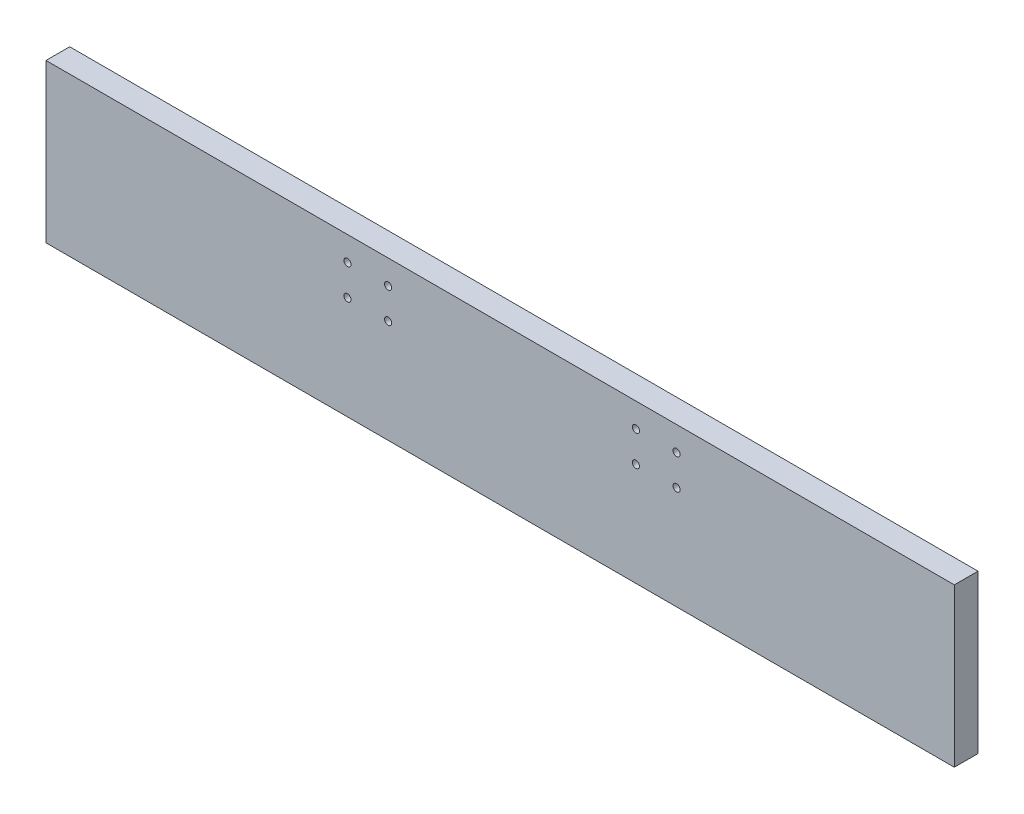
ISO-10303-21;
HEADER;
FILE_DESCRIPTION(('STEP AP214'),'2;1');
FILE_NAME('part.step','',(''),(''),'','','');
FILE_SCHEMA(('AUTOMOTIVE_DESIGN { 1 0 10303 214 1 1 1 1 }'));
ENDSEC;
DATA;
#1=APPLICATION_CONTEXT('core data for automotive mechanical design processes');
#2=APPLICATION_PROTOCOL_DEFINITION('international standard','automotive_design',2000,#1);
#3=PRODUCT_CONTEXT('',#1,'mechanical');
#4=PRODUCT('Part','Part','',(#3));
#5=PRODUCT_RELATED_PRODUCT_CATEGORY('part','',(#4));
#6=PRODUCT_DEFINITION_FORMATION('','',#4);
#7=PRODUCT_DEFINITION_CONTEXT('part definition',#1,'design');
#8=PRODUCT_DEFINITION('design','',#6,#7);
#9=PRODUCT_DEFINITION_SHAPE('','',#8);
#10=(LENGTH_UNIT() NAMED_UNIT(*) SI_UNIT(.MILLI.,.METRE.));
#11=(NAMED_UNIT(*) PLANE_ANGLE_UNIT() SI_UNIT($,.RADIAN.));
#12=(NAMED_UNIT(*) SI_UNIT($,.STERADIAN.) SOLID_ANGLE_UNIT());
#13=UNCERTAINTY_MEASURE_WITH_UNIT(LENGTH_MEASURE(1.E-05),#10,'distance_accuracy_value','');
#14=(GEOMETRIC_REPRESENTATION_CONTEXT(3) GLOBAL_UNCERTAINTY_ASSIGNED_CONTEXT((#13)) GLOBAL_UNIT_ASSIGNED_CONTEXT((#10,
#11,#12)) REPRESENTATION_CONTEXT('',''));
#15=CARTESIAN_POINT('',(0.,0.,0.));
#16=DIRECTION('',(0.,0.,1.));
#17=DIRECTION('',(1.,0.,0.));
#18=AXIS2_PLACEMENT_3D('',#15,#16,#17);
#19=CARTESIAN_POINT('',(0.,0.,19.05));
#20=DIRECTION('',(1.,0.,0.));
#21=DIRECTION('',(0.,0.,-1.));
#22=AXIS2_PLACEMENT_3D('',#19,#20,#21);
#23=PLANE('',#22);
#24=DIRECTION('',(0.,-1.,0.));
#25=VECTOR('',#24,1.);
#26=CARTESIAN_POINT('',(0.,0.,0.));
#27=LINE('',#26,#25);
#28=CARTESIAN_POINT('',(0.,127.,0.));
#29=VERTEX_POINT('',#28);
#30=CARTESIAN_POINT('',(0.,0.,0.));
#31=VERTEX_POINT('',#30);
#32=EDGE_CURVE('E96',#29,#31,#27,.T.);
#33=ORIENTED_EDGE('',*,*,#32,.T.);
#34=DIRECTION('',(0.,0.,-1.));
#35=VECTOR('',#34,1.);
#36=CARTESIAN_POINT('',(0.,0.,19.05));
#37=LINE('',#36,#35);
#38=CARTESIAN_POINT('',(0.,0.,19.05));
#39=VERTEX_POINT('',#38);
#40=EDGE_CURVE('E11',#39,#31,#37,.T.);
#41=ORIENTED_EDGE('',*,*,#40,.F.);
#42=DIRECTION('',(0.,-1.,0.));
#43=VECTOR('',#42,1.);
#44=CARTESIAN_POINT('',(0.,0.,19.05));
#45=LINE('',#44,#43);
#46=CARTESIAN_POINT('',(0.,127.,19.05));
#47=VERTEX_POINT('',#46);
#48=EDGE_CURVE('E84',#47,#39,#45,.T.);
#49=ORIENTED_EDGE('',*,*,#48,.F.);
#50=DIRECTION('',(0.,0.,-1.));
#51=VECTOR('',#50,1.);
#52=CARTESIAN_POINT('',(0.,127.,19.05));
#53=LINE('',#52,#51);
#54=EDGE_CURVE('E92',#47,#29,#53,.T.);
#55=ORIENTED_EDGE('',*,*,#54,.T.);
#56=EDGE_LOOP('',(#33,#41,#49,#55));
#57=FACE_BOUND('',#56,.T.);
#58=ADVANCED_FACE('F33',(#57),#23,.F.);
#59=CARTESIAN_POINT('',(0.,0.,19.05));
#60=DIRECTION('',(0.,1.,0.));
#61=DIRECTION('',(0.,0.,1.));
#62=AXIS2_PLACEMENT_3D('',#59,#60,#61);
#63=PLANE('',#62);
#64=DIRECTION('',(1.,0.,0.));
#65=VECTOR('',#64,1.);
#66=CARTESIAN_POINT('',(0.,0.,0.));
#67=LINE('',#66,#65);
#68=CARTESIAN_POINT('',(730.25,0.,0.));
#69=VERTEX_POINT('',#68);
#70=EDGE_CURVE('E88',#31,#69,#67,.T.);
#71=ORIENTED_EDGE('',*,*,#70,.T.);
#72=DIRECTION('',(0.,0.,-1.));
#73=VECTOR('',#72,1.);
#74=CARTESIAN_POINT('',(730.25,0.,19.05));
#75=LINE('',#74,#73);
#76=CARTESIAN_POINT('',(730.25,0.,19.05));
#77=VERTEX_POINT('',#76);
#78=EDGE_CURVE('E41',#77,#69,#75,.T.);
#79=ORIENTED_EDGE('',*,*,#78,.F.);
#80=DIRECTION('',(1.,0.,0.));
#81=VECTOR('',#80,1.);
#82=CARTESIAN_POINT('',(0.,0.,19.05));
#83=LINE('',#82,#81);
#84=EDGE_CURVE('E79',#39,#77,#83,.T.);
#85=ORIENTED_EDGE('',*,*,#84,.F.);
#86=ORIENTED_EDGE('',*,*,#40,.T.);
#87=EDGE_LOOP('',(#71,#79,#85,#86));
#88=FACE_BOUND('',#87,.T.);
#89=ADVANCED_FACE('F87',(#88),#63,.F.);
#90=CARTESIAN_POINT('',(730.25,0.,19.05));
#91=DIRECTION('',(-1.,0.,0.));
#92=DIRECTION('',(0.,0.,1.));
#93=AXIS2_PLACEMENT_3D('',#90,#91,#92);
#94=PLANE('',#93);
#95=DIRECTION('',(0.,1.,0.));
#96=VECTOR('',#95,1.);
#97=CARTESIAN_POINT('',(730.25,0.,0.));
#98=LINE('',#97,#96);
#99=CARTESIAN_POINT('',(730.25,127.,0.));
#100=VERTEX_POINT('',#99);
#101=EDGE_CURVE('E66',#69,#100,#98,.T.);
#102=ORIENTED_EDGE('',*,*,#101,.T.);
#103=DIRECTION('',(0.,0.,-1.));
#104=VECTOR('',#103,1.);
#105=CARTESIAN_POINT('',(730.25,127.,19.05));
#106=LINE('',#105,#104);
#107=CARTESIAN_POINT('',(730.25,127.,19.05));
#108=VERTEX_POINT('',#107);
#109=EDGE_CURVE('E89',#108,#100,#106,.T.);
#110=ORIENTED_EDGE('',*,*,#109,.F.);
#111=DIRECTION('',(0.,1.,0.));
#112=VECTOR('',#111,1.);
#113=CARTESIAN_POINT('',(730.25,0.,19.05));
#114=LINE('',#113,#112);
#115=EDGE_CURVE('E82',#77,#108,#114,.T.);
#116=ORIENTED_EDGE('',*,*,#115,.F.);
#117=ORIENTED_EDGE('',*,*,#78,.T.);
#118=EDGE_LOOP('',(#102,#110,#116,#117));
#119=FACE_BOUND('',#118,.T.);
#120=ADVANCED_FACE('F90',(#119),#94,.F.);
#121=CARTESIAN_POINT('',(0.,127.,19.05));
#122=DIRECTION('',(0.,-1.,0.));
#123=DIRECTION('',(0.,0.,-1.));
#124=AXIS2_PLACEMENT_3D('',#121,#122,#123);
#125=PLANE('',#124);
#126=DIRECTION('',(-1.,0.,0.));
#127=VECTOR('',#126,1.);
#128=CARTESIAN_POINT('',(0.,127.,0.));
#129=LINE('',#128,#127);
#130=EDGE_CURVE('E72',#100,#29,#129,.T.);
#131=ORIENTED_EDGE('',*,*,#130,.T.);
#132=ORIENTED_EDGE('',*,*,#54,.F.);
#133=DIRECTION('',(-1.,0.,0.));
#134=VECTOR('',#133,1.);
#135=CARTESIAN_POINT('',(0.,127.,19.05));
#136=LINE('',#135,#134);
#137=EDGE_CURVE('E49',#108,#47,#136,.T.);
#138=ORIENTED_EDGE('',*,*,#137,.F.);
#139=ORIENTED_EDGE('',*,*,#109,.T.);
#140=EDGE_LOOP('',(#131,#132,#138,#139));
#141=FACE_BOUND('',#140,.T.);
#142=ADVANCED_FACE('F104',(#141),#125,.F.);
#143=CARTESIAN_POINT('',(0.,0.,19.05));
#144=DIRECTION('',(0.,0.,-1.));
#145=DIRECTION('',(-1.,0.,0.));
#146=AXIS2_PLACEMENT_3D('',#143,#144,#145);
#147=PLANE('',#146);
#148=CARTESIAN_POINT('',(242.373149999996,107.537250000002,19.05));
#149=DIRECTION('',(0.,0.,1.));
#150=DIRECTION('',(1.,0.,0.));
#151=AXIS2_PLACEMENT_3D('',#148,#149,#150);
#152=CIRCLE('',#151,2.85115);
#153=CARTESIAN_POINT('',(245.224299999996,107.537250000002,19.05));
#154=VERTEX_POINT('',#153);
#155=EDGE_CURVE('E113',#154,#154,#152,.T.);
#156=ORIENTED_EDGE('',*,*,#155,.F.);
#157=EDGE_LOOP('',(#156));
#158=FACE_BOUND('',#157,.T.);
#159=CARTESIAN_POINT('',(275.024849999996,107.537250000002,19.05));
#160=DIRECTION('',(0.,0.,1.));
#161=DIRECTION('',(1.,0.,0.));
#162=AXIS2_PLACEMENT_3D('',#159,#160,#161);
#163=CIRCLE('',#162,2.85115000000003);
#164=CARTESIAN_POINT('',(277.875999999996,107.537250000002,19.05));
#165=VERTEX_POINT('',#164);
#166=EDGE_CURVE('E132',#165,#165,#163,.T.);
#167=ORIENTED_EDGE('',*,*,#166,.F.);
#168=EDGE_LOOP('',(#167));
#169=FACE_BOUND('',#168,.T.);
#170=CARTESIAN_POINT('',(275.024849999997,82.9627500000021,19.05));
#171=DIRECTION('',(0.,0.,1.));
#172=DIRECTION('',(1.,0.,0.));
#173=AXIS2_PLACEMENT_3D('',#170,#171,#172);
#174=CIRCLE('',#173,2.85114999999997);
#175=CARTESIAN_POINT('',(277.875999999997,82.9627500000021,19.05));
#176=VERTEX_POINT('',#175);
#177=EDGE_CURVE('E126',#176,#176,#174,.T.);
#178=ORIENTED_EDGE('',*,*,#177,.F.);
#179=EDGE_LOOP('',(#178));
#180=FACE_BOUND('',#179,.T.);
#181=CARTESIAN_POINT('',(474.275149999997,82.9627500000035,19.05));
#182=DIRECTION('',(0.,0.,1.));
#183=DIRECTION('',(1.,0.,0.));
#184=AXIS2_PLACEMENT_3D('',#181,#182,#183);
#185=CIRCLE('',#184,2.85114999999997);
#186=CARTESIAN_POINT('',(477.126299999997,82.9627500000035,19.05));
#187=VERTEX_POINT('',#186);
#188=EDGE_CURVE('E119',#187,#187,#185,.T.);
#189=ORIENTED_EDGE('',*,*,#188,.F.);
#190=EDGE_LOOP('',(#189));
#191=FACE_BOUND('',#190,.T.);
#192=CARTESIAN_POINT('',(474.275149999996,107.537250000004,19.05));
#193=DIRECTION('',(0.,0.,1.));
#194=DIRECTION('',(1.,0.,0.));
#195=AXIS2_PLACEMENT_3D('',#192,#193,#194);
#196=CIRCLE('',#195,2.85114999999997);
#197=CARTESIAN_POINT('',(477.126299999996,107.537250000004,19.05));
#198=VERTEX_POINT('',#197);
#199=EDGE_CURVE('E120',#198,#198,#196,.T.);
#200=ORIENTED_EDGE('',*,*,#199,.F.);
#201=EDGE_LOOP('',(#200));
#202=FACE_BOUND('',#201,.T.);
#203=CARTESIAN_POINT('',(506.926849999996,107.537250000004,19.05));
#204=DIRECTION('',(0.,0.,1.));
#205=DIRECTION('',(1.,0.,0.));
#206=AXIS2_PLACEMENT_3D('',#203,#204,#205);
#207=CIRCLE('',#206,2.85115000000009);
#208=CARTESIAN_POINT('',(509.777999999997,107.537250000004,19.05));
#209=VERTEX_POINT('',#208);
#210=EDGE_CURVE('E149',#209,#209,#207,.T.);
#211=ORIENTED_EDGE('',*,*,#210,.F.);
#212=EDGE_LOOP('',(#211));
#213=FACE_BOUND('',#212,.T.);
#214=CARTESIAN_POINT('',(506.926849999997,82.9627500000037,19.05));
#215=DIRECTION('',(0.,0.,1.));
#216=DIRECTION('',(1.,0.,0.));
#217=AXIS2_PLACEMENT_3D('',#214,#215,#216);
#218=CIRCLE('',#217,2.85115000000009);
#219=CARTESIAN_POINT('',(509.777999999997,82.9627500000037,19.05));
#220=VERTEX_POINT('',#219);
#221=EDGE_CURVE('E143',#220,#220,#218,.T.);
#222=ORIENTED_EDGE('',*,*,#221,.F.);
#223=EDGE_LOOP('',(#222));
#224=FACE_BOUND('',#223,.T.);
#225=CARTESIAN_POINT('',(242.373149999997,82.9627500000018,19.05));
#226=DIRECTION('',(0.,0.,1.));
#227=DIRECTION('',(1.,0.,0.));
#228=AXIS2_PLACEMENT_3D('',#225,#226,#227);
#229=CIRCLE('',#228,2.85115);
#230=CARTESIAN_POINT('',(245.224299999997,82.9627500000018,19.05));
#231=VERTEX_POINT('',#230);
#232=EDGE_CURVE('E99',#231,#231,#229,.T.);
#233=ORIENTED_EDGE('',*,*,#232,.F.);
#234=EDGE_LOOP('',(#233));
#235=FACE_BOUND('',#234,.T.);
#236=ORIENTED_EDGE('',*,*,#48,.T.);
#237=ORIENTED_EDGE('',*,*,#84,.T.);
#238=ORIENTED_EDGE('',*,*,#115,.T.);
#239=ORIENTED_EDGE('',*,*,#137,.T.);
#240=EDGE_LOOP('',(#236,#237,#238,#239));
#241=FACE_BOUND('',#240,.T.);
#242=ADVANCED_FACE('F80',(#158,#169,#180,#191,#202,#213,#224,#235,#241),#147,.F.);
#243=CARTESIAN_POINT('',(0.,0.,0.));
#244=DIRECTION('',(0.,0.,-1.));
#245=DIRECTION('',(-1.,0.,0.));
#246=AXIS2_PLACEMENT_3D('',#243,#244,#245);
#247=PLANE('',#246);
#248=CARTESIAN_POINT('',(242.373149999996,107.537250000002,0.));
#249=DIRECTION('',(0.,0.,-1.));
#250=DIRECTION('',(-1.,0.,0.));
#251=AXIS2_PLACEMENT_3D('',#248,#249,#250);
#252=CIRCLE('',#251,2.85115);
#253=CARTESIAN_POINT('',(239.521999999996,107.537250000002,0.));
#254=VERTEX_POINT('',#253);
#255=EDGE_CURVE('E135',#254,#254,#252,.F.);
#256=ORIENTED_EDGE('',*,*,#255,.T.);
#257=EDGE_LOOP('',(#256));
#258=FACE_BOUND('',#257,.T.);
#259=CARTESIAN_POINT('',(275.024849999996,107.537250000002,0.));
#260=DIRECTION('',(0.,0.,-1.));
#261=DIRECTION('',(-1.,0.,0.));
#262=AXIS2_PLACEMENT_3D('',#259,#260,#261);
#263=CIRCLE('',#262,2.85115000000003);
#264=CARTESIAN_POINT('',(272.173699999996,107.537250000002,0.));
#265=VERTEX_POINT('',#264);
#266=EDGE_CURVE('E129',#265,#265,#263,.F.);
#267=ORIENTED_EDGE('',*,*,#266,.T.);
#268=EDGE_LOOP('',(#267));
#269=FACE_BOUND('',#268,.T.);
#270=CARTESIAN_POINT('',(275.024849999997,82.9627500000021,0.));
#271=DIRECTION('',(0.,0.,-1.));
#272=DIRECTION('',(-1.,0.,0.));
#273=AXIS2_PLACEMENT_3D('',#270,#271,#272);
#274=CIRCLE('',#273,2.85114999999997);
#275=CARTESIAN_POINT('',(272.173699999997,82.9627500000021,0.));
#276=VERTEX_POINT('',#275);
#277=EDGE_CURVE('E123',#276,#276,#274,.F.);
#278=ORIENTED_EDGE('',*,*,#277,.T.);
#279=EDGE_LOOP('',(#278));
#280=FACE_BOUND('',#279,.T.);
#281=CARTESIAN_POINT('',(474.275149999997,82.9627500000035,0.));
#282=DIRECTION('',(0.,0.,-1.));
#283=DIRECTION('',(-1.,0.,0.));
#284=AXIS2_PLACEMENT_3D('',#281,#282,#283);
#285=CIRCLE('',#284,2.85114999999997);
#286=CARTESIAN_POINT('',(471.423999999997,82.9627500000035,0.));
#287=VERTEX_POINT('',#286);
#288=EDGE_CURVE('E116',#287,#287,#285,.F.);
#289=ORIENTED_EDGE('',*,*,#288,.T.);
#290=EDGE_LOOP('',(#289));
#291=FACE_BOUND('',#290,.T.);
#292=CARTESIAN_POINT('',(474.275149999996,107.537250000004,0.));
#293=DIRECTION('',(0.,0.,-1.));
#294=DIRECTION('',(-1.,0.,0.));
#295=AXIS2_PLACEMENT_3D('',#292,#293,#294);
#296=CIRCLE('',#295,2.85114999999997);
#297=CARTESIAN_POINT('',(471.423999999997,107.537250000004,0.));
#298=VERTEX_POINT('',#297);
#299=EDGE_CURVE('E152',#298,#298,#296,.F.);
#300=ORIENTED_EDGE('',*,*,#299,.T.);
#301=EDGE_LOOP('',(#300));
#302=FACE_BOUND('',#301,.T.);
#303=CARTESIAN_POINT('',(506.926849999996,107.537250000004,0.));
#304=DIRECTION('',(0.,0.,-1.));
#305=DIRECTION('',(-1.,0.,0.));
#306=AXIS2_PLACEMENT_3D('',#303,#304,#305);
#307=CIRCLE('',#306,2.85115000000009);
#308=CARTESIAN_POINT('',(504.075699999996,107.537250000004,0.));
#309=VERTEX_POINT('',#308);
#310=EDGE_CURVE('E146',#309,#309,#307,.F.);
#311=ORIENTED_EDGE('',*,*,#310,.T.);
#312=EDGE_LOOP('',(#311));
#313=FACE_BOUND('',#312,.T.);
#314=CARTESIAN_POINT('',(506.926849999997,82.9627500000037,0.));
#315=DIRECTION('',(0.,0.,-1.));
#316=DIRECTION('',(-1.,0.,0.));
#317=AXIS2_PLACEMENT_3D('',#314,#315,#316);
#318=CIRCLE('',#317,2.85115000000009);
#319=CARTESIAN_POINT('',(504.075699999996,82.9627500000037,0.));
#320=VERTEX_POINT('',#319);
#321=EDGE_CURVE('E140',#320,#320,#318,.F.);
#322=ORIENTED_EDGE('',*,*,#321,.T.);
#323=EDGE_LOOP('',(#322));
#324=FACE_BOUND('',#323,.T.);
#325=CARTESIAN_POINT('',(242.373149999997,82.9627500000018,0.));
#326=DIRECTION('',(0.,0.,-1.));
#327=DIRECTION('',(-1.,0.,0.));
#328=AXIS2_PLACEMENT_3D('',#325,#326,#327);
#329=CIRCLE('',#328,2.85115);
#330=CARTESIAN_POINT('',(239.521999999997,82.9627500000018,0.));
#331=VERTEX_POINT('',#330);
#332=EDGE_CURVE('E110',#331,#331,#329,.F.);
#333=ORIENTED_EDGE('',*,*,#332,.T.);
#334=EDGE_LOOP('',(#333));
#335=FACE_BOUND('',#334,.T.);
#336=ORIENTED_EDGE('',*,*,#32,.F.);
#337=ORIENTED_EDGE('',*,*,#130,.F.);
#338=ORIENTED_EDGE('',*,*,#101,.F.);
#339=ORIENTED_EDGE('',*,*,#70,.F.);
#340=EDGE_LOOP('',(#336,#337,#338,#339));
#341=FACE_BOUND('',#340,.T.);
#342=ADVANCED_FACE('F107',(#258,#269,#280,#291,#302,#313,#324,#335,#341),#247,.T.);
#343=CARTESIAN_POINT('',(242.373149999997,82.9627500000018,-0.001000000000001));
#344=DIRECTION('',(0.,0.,1.));
#345=DIRECTION('',(1.,0.,0.));
#346=AXIS2_PLACEMENT_3D('',#343,#344,#345);
#347=CYLINDRICAL_SURFACE('',#346,2.85115);
#348=ORIENTED_EDGE('',*,*,#332,.F.);
#349=EDGE_LOOP('',(#348));
#350=FACE_BOUND('',#349,.T.);
#351=ORIENTED_EDGE('',*,*,#232,.T.);
#352=EDGE_LOOP('',(#351));
#353=FACE_BOUND('',#352,.T.);
#354=ADVANCED_FACE('F170',(#350,#353),#347,.F.);
#355=CARTESIAN_POINT('',(506.926849999997,82.9627500000037,-0.001000000000001));
#356=DIRECTION('',(0.,0.,1.));
#357=DIRECTION('',(1.,0.,0.));
#358=AXIS2_PLACEMENT_3D('',#355,#356,#357);
#359=CYLINDRICAL_SURFACE('',#358,2.85115000000009);
#360=ORIENTED_EDGE('',*,*,#321,.F.);
#361=EDGE_LOOP('',(#360));
#362=FACE_BOUND('',#361,.T.);
#363=ORIENTED_EDGE('',*,*,#221,.T.);
#364=EDGE_LOOP('',(#363));
#365=FACE_BOUND('',#364,.T.);
#366=ADVANCED_FACE('F172',(#362,#365),#359,.F.);
#367=CARTESIAN_POINT('',(506.926849999996,107.537250000004,-0.001000000000001));
#368=DIRECTION('',(0.,0.,1.));
#369=DIRECTION('',(1.,0.,0.));
#370=AXIS2_PLACEMENT_3D('',#367,#368,#369);
#371=CYLINDRICAL_SURFACE('',#370,2.85115000000009);
#372=ORIENTED_EDGE('',*,*,#310,.F.);
#373=EDGE_LOOP('',(#372));
#374=FACE_BOUND('',#373,.T.);
#375=ORIENTED_EDGE('',*,*,#210,.T.);
#376=EDGE_LOOP('',(#375));
#377=FACE_BOUND('',#376,.T.);
#378=ADVANCED_FACE('F179',(#374,#377),#371,.F.);
#379=CARTESIAN_POINT('',(474.275149999996,107.537250000004,-0.001000000000001));
#380=DIRECTION('',(0.,0.,1.));
#381=DIRECTION('',(1.,0.,0.));
#382=AXIS2_PLACEMENT_3D('',#379,#380,#381);
#383=CYLINDRICAL_SURFACE('',#382,2.85114999999997);
#384=ORIENTED_EDGE('',*,*,#299,.F.);
#385=EDGE_LOOP('',(#384));
#386=FACE_BOUND('',#385,.T.);
#387=ORIENTED_EDGE('',*,*,#199,.T.);
#388=EDGE_LOOP('',(#387));
#389=FACE_BOUND('',#388,.T.);
#390=ADVANCED_FACE('F158',(#386,#389),#383,.F.);
#391=CARTESIAN_POINT('',(474.275149999997,82.9627500000035,-0.001000000000001));
#392=DIRECTION('',(0.,0.,1.));
#393=DIRECTION('',(1.,0.,0.));
#394=AXIS2_PLACEMENT_3D('',#391,#392,#393);
#395=CYLINDRICAL_SURFACE('',#394,2.85114999999997);
#396=ORIENTED_EDGE('',*,*,#288,.F.);
#397=EDGE_LOOP('',(#396));
#398=FACE_BOUND('',#397,.T.);
#399=ORIENTED_EDGE('',*,*,#188,.T.);
#400=EDGE_LOOP('',(#399));
#401=FACE_BOUND('',#400,.T.);
#402=ADVANCED_FACE('F238',(#398,#401),#395,.F.);
#403=CARTESIAN_POINT('',(275.024849999997,82.9627500000021,-0.001000000000001));
#404=DIRECTION('',(0.,0.,1.));
#405=DIRECTION('',(1.,0.,0.));
#406=AXIS2_PLACEMENT_3D('',#403,#404,#405);
#407=CYLINDRICAL_SURFACE('',#406,2.85114999999997);
#408=ORIENTED_EDGE('',*,*,#277,.F.);
#409=EDGE_LOOP('',(#408));
#410=FACE_BOUND('',#409,.T.);
#411=ORIENTED_EDGE('',*,*,#177,.T.);
#412=EDGE_LOOP('',(#411));
#413=FACE_BOUND('',#412,.T.);
#414=ADVANCED_FACE('F248',(#410,#413),#407,.F.);
#415=CARTESIAN_POINT('',(275.024849999996,107.537250000002,-0.001000000000001));
#416=DIRECTION('',(0.,0.,1.));
#417=DIRECTION('',(1.,0.,0.));
#418=AXIS2_PLACEMENT_3D('',#415,#416,#417);
#419=CYLINDRICAL_SURFACE('',#418,2.85115000000003);
#420=ORIENTED_EDGE('',*,*,#266,.F.);
#421=EDGE_LOOP('',(#420));
#422=FACE_BOUND('',#421,.T.);
#423=ORIENTED_EDGE('',*,*,#166,.T.);
#424=EDGE_LOOP('',(#423));
#425=FACE_BOUND('',#424,.T.);
#426=ADVANCED_FACE('F257',(#422,#425),#419,.F.);
#427=CARTESIAN_POINT('',(242.373149999996,107.537250000002,-0.001000000000001));
#428=DIRECTION('',(0.,0.,1.));
#429=DIRECTION('',(1.,0.,0.));
#430=AXIS2_PLACEMENT_3D('',#427,#428,#429);
#431=CYLINDRICAL_SURFACE('',#430,2.85115);
#432=ORIENTED_EDGE('',*,*,#255,.F.);
#433=EDGE_LOOP('',(#432));
#434=FACE_BOUND('',#433,.T.);
#435=ORIENTED_EDGE('',*,*,#155,.T.);
#436=EDGE_LOOP('',(#435));
#437=FACE_BOUND('',#436,.T.);
#438=ADVANCED_FACE('F267',(#434,#437),#431,.F.);
#439=CLOSED_SHELL('',(#58,#89,#120,#142,#242,#342,#354,#366,#378,#390,#402,#414,#426,#438));
#440=MANIFOLD_SOLID_BREP('B2',#439);
#441=ADVANCED_BREP_SHAPE_REPRESENTATION('',(#18,#440),#14);
#442=SHAPE_DEFINITION_REPRESENTATION(#9,#441);
ENDSEC;
END-ISO-10303-21;
